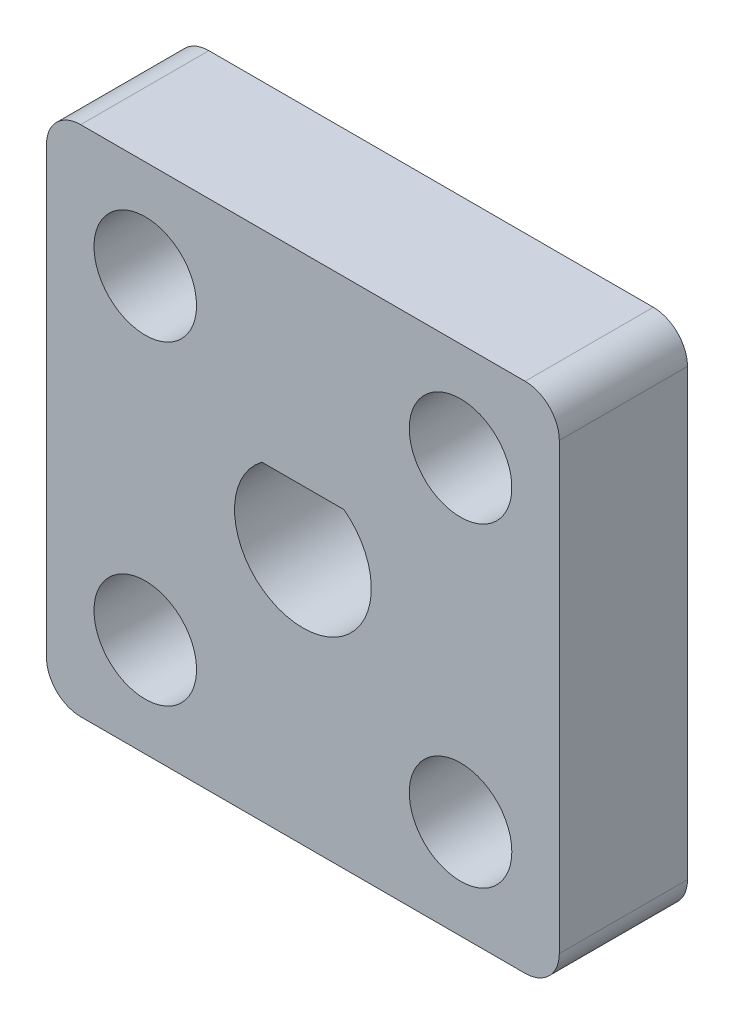
ISO-10303-21;
HEADER;
FILE_DESCRIPTION(('STEP AP214'),'2;1');
FILE_NAME('part.step','',(''),(''),'','','');
FILE_SCHEMA(('AUTOMOTIVE_DESIGN { 1 0 10303 214 1 1 1 1 }'));
ENDSEC;
DATA;
#1=APPLICATION_CONTEXT('core data for automotive mechanical design processes');
#2=APPLICATION_PROTOCOL_DEFINITION('international standard','automotive_design',2000,#1);
#3=PRODUCT_CONTEXT('',#1,'mechanical');
#4=PRODUCT('Part','Part','',(#3));
#5=PRODUCT_RELATED_PRODUCT_CATEGORY('part','',(#4));
#6=PRODUCT_DEFINITION_FORMATION('','',#4);
#7=PRODUCT_DEFINITION_CONTEXT('part definition',#1,'design');
#8=PRODUCT_DEFINITION('design','',#6,#7);
#9=PRODUCT_DEFINITION_SHAPE('','',#8);
#10=(LENGTH_UNIT() NAMED_UNIT(*) SI_UNIT(.MILLI.,.METRE.));
#11=(NAMED_UNIT(*) PLANE_ANGLE_UNIT() SI_UNIT($,.RADIAN.));
#12=(NAMED_UNIT(*) SI_UNIT($,.STERADIAN.) SOLID_ANGLE_UNIT());
#13=UNCERTAINTY_MEASURE_WITH_UNIT(LENGTH_MEASURE(1.E-05),#10,'distance_accuracy_value','');
#14=(GEOMETRIC_REPRESENTATION_CONTEXT(3) GLOBAL_UNCERTAINTY_ASSIGNED_CONTEXT((#13)) GLOBAL_UNIT_ASSIGNED_CONTEXT((#10,
#11,#12)) REPRESENTATION_CONTEXT('',''));
#15=CARTESIAN_POINT('',(0.,0.,0.));
#16=DIRECTION('',(0.,0.,1.));
#17=DIRECTION('',(1.,0.,0.));
#18=AXIS2_PLACEMENT_3D('',#15,#16,#17);
#19=CARTESIAN_POINT('',(-2.89434350433073,13.9923461159468,4.7625));
#20=DIRECTION('',(0.,0.,-1.));
#21=DIRECTION('',(-1.,0.,0.));
#22=AXIS2_PLACEMENT_3D('',#19,#20,#21);
#23=PLANE('',#22);
#24=CARTESIAN_POINT('',(-17.0056523090998,-0.118962688822236,4.7625));
#25=DIRECTION('',(0.,0.,1.));
#26=DIRECTION('',(-1.,0.,0.));
#27=AXIS2_PLACEMENT_3D('',#24,#25,#26);
#28=CIRCLE('',#27,1.905);
#29=CARTESIAN_POINT('',(-18.9106523090998,-0.118962688822236,4.7625));
#30=VERTEX_POINT('',#29);
#31=EDGE_CURVE('E145',#30,#30,#28,.T.);
#32=ORIENTED_EDGE('',*,*,#31,.F.);
#33=EDGE_LOOP('',(#32));
#34=FACE_BOUND('',#33,.T.);
#35=CARTESIAN_POINT('',(-5.29303469956163,-0.118962688822236,4.7625));
#36=DIRECTION('',(0.,0.,1.));
#37=DIRECTION('',(1.,0.,0.));
#38=AXIS2_PLACEMENT_3D('',#35,#36,#37);
#39=CIRCLE('',#38,1.905);
#40=CARTESIAN_POINT('',(-3.38803469956163,-0.118962688822236,4.7625));
#41=VERTEX_POINT('',#40);
#42=EDGE_CURVE('E153',#41,#41,#39,.T.);
#43=ORIENTED_EDGE('',*,*,#42,.F.);
#44=EDGE_LOOP('',(#43));
#45=FACE_BOUND('',#44,.T.);
#46=CARTESIAN_POINT('',(-5.29303469956163,11.5936549207159,4.7625));
#47=DIRECTION('',(0.,0.,1.));
#48=DIRECTION('',(-1.,0.,0.));
#49=AXIS2_PLACEMENT_3D('',#46,#47,#48);
#50=CIRCLE('',#49,1.905);
#51=CARTESIAN_POINT('',(-7.19803469956163,11.5936549207159,4.7625));
#52=VERTEX_POINT('',#51);
#53=EDGE_CURVE('E161',#52,#52,#50,.T.);
#54=ORIENTED_EDGE('',*,*,#53,.F.);
#55=EDGE_LOOP('',(#54));
#56=FACE_BOUND('',#55,.T.);
#57=CARTESIAN_POINT('',(-17.0056523090998,11.5936549207159,4.7625));
#58=DIRECTION('',(0.,0.,1.));
#59=DIRECTION('',(1.,0.,0.));
#60=AXIS2_PLACEMENT_3D('',#57,#58,#59);
#61=CIRCLE('',#60,1.905);
#62=CARTESIAN_POINT('',(-15.1006523090998,11.5936549207159,4.7625));
#63=VERTEX_POINT('',#62);
#64=EDGE_CURVE('E169',#63,#63,#61,.T.);
#65=ORIENTED_EDGE('',*,*,#64,.F.);
#66=EDGE_LOOP('',(#65));
#67=FACE_BOUND('',#66,.T.);
#68=CARTESIAN_POINT('',(-2.89434350433073,13.9923461159468,4.7625));
#69=DIRECTION('',(0.,0.,1.));
#70=DIRECTION('',(-1.,0.,0.));
#71=AXIS2_PLACEMENT_3D('',#68,#69,#70);
#72=CIRCLE('',#71,1.27);
#73=CARTESIAN_POINT('',(-1.62434350433073,13.9923461159468,4.7625));
#74=VERTEX_POINT('',#73);
#75=CARTESIAN_POINT('',(-2.89434350433074,15.2623461159468,4.7625));
#76=VERTEX_POINT('',#75);
#77=EDGE_CURVE('E177',#74,#76,#72,.T.);
#78=ORIENTED_EDGE('',*,*,#77,.T.);
#79=DIRECTION('',(-1.,0.,0.));
#80=VECTOR('',#79,1.);
#81=CARTESIAN_POINT('',(-19.4043435043307,15.2623461159468,4.7625));
#82=LINE('',#81,#80);
#83=CARTESIAN_POINT('',(-19.4043435043307,15.2623461159468,4.7625));
#84=VERTEX_POINT('',#83);
#85=EDGE_CURVE('E181',#76,#84,#82,.T.);
#86=ORIENTED_EDGE('',*,*,#85,.T.);
#87=CARTESIAN_POINT('',(-19.4043435043307,13.9923461159468,4.7625));
#88=DIRECTION('',(0.,0.,1.));
#89=DIRECTION('',(-1.,0.,0.));
#90=AXIS2_PLACEMENT_3D('',#87,#88,#89);
#91=CIRCLE('',#90,1.27);
#92=CARTESIAN_POINT('',(-20.6743435043307,13.9923461159468,4.7625));
#93=VERTEX_POINT('',#92);
#94=EDGE_CURVE('E185',#84,#93,#91,.T.);
#95=ORIENTED_EDGE('',*,*,#94,.T.);
#96=DIRECTION('',(0.,-1.,0.));
#97=VECTOR('',#96,1.);
#98=CARTESIAN_POINT('',(-20.6743435043307,-2.51765388405314,4.7625));
#99=LINE('',#98,#97);
#100=CARTESIAN_POINT('',(-20.6743435043307,-2.51765388405314,4.7625));
#101=VERTEX_POINT('',#100);
#102=EDGE_CURVE('E188',#93,#101,#99,.T.);
#103=ORIENTED_EDGE('',*,*,#102,.T.);
#104=CARTESIAN_POINT('',(-19.4043435043307,-2.51765388405315,4.7625));
#105=DIRECTION('',(0.,0.,1.));
#106=DIRECTION('',(-1.,0.,0.));
#107=AXIS2_PLACEMENT_3D('',#104,#105,#106);
#108=CIRCLE('',#107,1.27);
#109=CARTESIAN_POINT('',(-19.4043435043307,-3.78765388405315,4.7625));
#110=VERTEX_POINT('',#109);
#111=EDGE_CURVE('E191',#101,#110,#108,.T.);
#112=ORIENTED_EDGE('',*,*,#111,.T.);
#113=DIRECTION('',(1.,0.,0.));
#114=VECTOR('',#113,1.);
#115=CARTESIAN_POINT('',(-19.4043435043307,-3.78765388405315,4.7625));
#116=LINE('',#115,#114);
#117=CARTESIAN_POINT('',(-2.89434350433074,-3.78765388405315,4.7625));
#118=VERTEX_POINT('',#117);
#119=EDGE_CURVE('E194',#110,#118,#116,.T.);
#120=ORIENTED_EDGE('',*,*,#119,.T.);
#121=CARTESIAN_POINT('',(-2.89434350433073,-2.51765388405315,4.7625));
#122=DIRECTION('',(0.,0.,1.));
#123=DIRECTION('',(1.,0.,0.));
#124=AXIS2_PLACEMENT_3D('',#121,#122,#123);
#125=CIRCLE('',#124,1.27);
#126=CARTESIAN_POINT('',(-1.62434350433073,-2.51765388405315,4.7625));
#127=VERTEX_POINT('',#126);
#128=EDGE_CURVE('E197',#118,#127,#125,.T.);
#129=ORIENTED_EDGE('',*,*,#128,.T.);
#130=DIRECTION('',(0.,1.,0.));
#131=VECTOR('',#130,1.);
#132=CARTESIAN_POINT('',(-1.62434350433073,-2.51765388405314,4.7625));
#133=LINE('',#132,#131);
#134=EDGE_CURVE('E200',#127,#74,#133,.T.);
#135=ORIENTED_EDGE('',*,*,#134,.T.);
#136=EDGE_LOOP('',(#78,#86,#95,#103,#112,#120,#129,#135));
#137=FACE_BOUND('',#136,.T.);
#138=CARTESIAN_POINT('',(-11.1493435043307,5.73734611594685,4.7625));
#139=DIRECTION('',(0.,0.,1.));
#140=DIRECTION('',(1.,0.,0.));
#141=AXIS2_PLACEMENT_3D('',#138,#139,#140);
#142=CIRCLE('',#141,2.54);
#143=CARTESIAN_POINT('',(-12.6733435043307,7.76934611594685,4.7625));
#144=VERTEX_POINT('',#143);
#145=CARTESIAN_POINT('',(-9.62534350433073,7.76934611594685,4.7625));
#146=VERTEX_POINT('',#145);
#147=EDGE_CURVE('E129',#144,#146,#142,.T.);
#148=ORIENTED_EDGE('',*,*,#147,.F.);
#149=DIRECTION('',(-1.,0.,0.));
#150=VECTOR('',#149,1.);
#151=CARTESIAN_POINT('',(-12.6733435043307,7.76934611594685,4.7625));
#152=LINE('',#151,#150);
#153=EDGE_CURVE('E122',#146,#144,#152,.T.);
#154=ORIENTED_EDGE('',*,*,#153,.F.);
#155=EDGE_LOOP('',(#148,#154));
#156=FACE_BOUND('',#155,.T.);
#157=ADVANCED_FACE('F45',(#34,#45,#56,#67,#137,#156),#23,.F.);
#158=CARTESIAN_POINT('',(-2.89434350433073,13.9923461159468,0.));
#159=DIRECTION('',(0.,0.,-1.));
#160=DIRECTION('',(-1.,0.,0.));
#161=AXIS2_PLACEMENT_3D('',#158,#159,#160);
#162=PLANE('',#161);
#163=CARTESIAN_POINT('',(-5.29303469956163,-0.118962688822236,0.));
#164=DIRECTION('',(0.,0.,1.));
#165=DIRECTION('',(1.,0.,0.));
#166=AXIS2_PLACEMENT_3D('',#163,#164,#165);
#167=CIRCLE('',#166,1.905);
#168=CARTESIAN_POINT('',(-3.38803469956163,-0.118962688822236,0.));
#169=VERTEX_POINT('',#168);
#170=EDGE_CURVE('E149',#169,#169,#167,.T.);
#171=ORIENTED_EDGE('',*,*,#170,.T.);
#172=EDGE_LOOP('',(#171));
#173=FACE_BOUND('',#172,.T.);
#174=CARTESIAN_POINT('',(-17.0056523090998,11.5936549207159,0.));
#175=DIRECTION('',(0.,0.,1.));
#176=DIRECTION('',(1.,0.,0.));
#177=AXIS2_PLACEMENT_3D('',#174,#175,#176);
#178=CIRCLE('',#177,1.905);
#179=CARTESIAN_POINT('',(-15.1006523090998,11.5936549207159,0.));
#180=VERTEX_POINT('',#179);
#181=EDGE_CURVE('E165',#180,#180,#178,.T.);
#182=ORIENTED_EDGE('',*,*,#181,.T.);
#183=EDGE_LOOP('',(#182));
#184=FACE_BOUND('',#183,.T.);
#185=CARTESIAN_POINT('',(-2.89434350433073,13.9923461159468,0.));
#186=DIRECTION('',(0.,0.,1.));
#187=DIRECTION('',(-1.,0.,0.));
#188=AXIS2_PLACEMENT_3D('',#185,#186,#187);
#189=CIRCLE('',#188,1.27);
#190=CARTESIAN_POINT('',(-1.62434350433073,13.9923461159468,0.));
#191=VERTEX_POINT('',#190);
#192=CARTESIAN_POINT('',(-2.89434350433074,15.2623461159468,0.));
#193=VERTEX_POINT('',#192);
#194=EDGE_CURVE('E173',#191,#193,#189,.T.);
#195=ORIENTED_EDGE('',*,*,#194,.F.);
#196=DIRECTION('',(0.,1.,0.));
#197=VECTOR('',#196,1.);
#198=CARTESIAN_POINT('',(-1.62434350433073,-2.51765388405314,0.));
#199=LINE('',#198,#197);
#200=CARTESIAN_POINT('',(-1.62434350433073,-2.51765388405315,0.));
#201=VERTEX_POINT('',#200);
#202=EDGE_CURVE('E182',#201,#191,#199,.T.);
#203=ORIENTED_EDGE('',*,*,#202,.F.);
#204=CARTESIAN_POINT('',(-2.89434350433073,-2.51765388405315,0.));
#205=DIRECTION('',(0.,0.,1.));
#206=DIRECTION('',(1.,0.,0.));
#207=AXIS2_PLACEMENT_3D('',#204,#205,#206);
#208=CIRCLE('',#207,1.27);
#209=CARTESIAN_POINT('',(-2.89434350433074,-3.78765388405315,0.));
#210=VERTEX_POINT('',#209);
#211=EDGE_CURVE('E222',#210,#201,#208,.T.);
#212=ORIENTED_EDGE('',*,*,#211,.F.);
#213=DIRECTION('',(1.,0.,0.));
#214=VECTOR('',#213,1.);
#215=CARTESIAN_POINT('',(-19.4043435043307,-3.78765388405315,0.));
#216=LINE('',#215,#214);
#217=CARTESIAN_POINT('',(-19.4043435043307,-3.78765388405315,0.));
#218=VERTEX_POINT('',#217);
#219=EDGE_CURVE('E219',#218,#210,#216,.T.);
#220=ORIENTED_EDGE('',*,*,#219,.F.);
#221=CARTESIAN_POINT('',(-19.4043435043307,-2.51765388405315,0.));
#222=DIRECTION('',(0.,0.,1.));
#223=DIRECTION('',(-1.,0.,0.));
#224=AXIS2_PLACEMENT_3D('',#221,#222,#223);
#225=CIRCLE('',#224,1.27);
#226=CARTESIAN_POINT('',(-20.6743435043307,-2.51765388405314,0.));
#227=VERTEX_POINT('',#226);
#228=EDGE_CURVE('E216',#227,#218,#225,.T.);
#229=ORIENTED_EDGE('',*,*,#228,.F.);
#230=DIRECTION('',(0.,-1.,0.));
#231=VECTOR('',#230,1.);
#232=CARTESIAN_POINT('',(-20.6743435043307,-2.51765388405314,0.));
#233=LINE('',#232,#231);
#234=CARTESIAN_POINT('',(-20.6743435043307,13.9923461159468,0.));
#235=VERTEX_POINT('',#234);
#236=EDGE_CURVE('E213',#235,#227,#233,.T.);
#237=ORIENTED_EDGE('',*,*,#236,.F.);
#238=CARTESIAN_POINT('',(-19.4043435043307,13.9923461159468,0.));
#239=DIRECTION('',(0.,0.,1.));
#240=DIRECTION('',(-1.,0.,0.));
#241=AXIS2_PLACEMENT_3D('',#238,#239,#240);
#242=CIRCLE('',#241,1.27);
#243=CARTESIAN_POINT('',(-19.4043435043307,15.2623461159468,0.));
#244=VERTEX_POINT('',#243);
#245=EDGE_CURVE('E210',#244,#235,#242,.T.);
#246=ORIENTED_EDGE('',*,*,#245,.F.);
#247=DIRECTION('',(-1.,0.,0.));
#248=VECTOR('',#247,1.);
#249=CARTESIAN_POINT('',(-19.4043435043307,15.2623461159468,0.));
#250=LINE('',#249,#248);
#251=EDGE_CURVE('E207',#193,#244,#250,.T.);
#252=ORIENTED_EDGE('',*,*,#251,.F.);
#253=EDGE_LOOP('',(#195,#203,#212,#220,#229,#237,#246,#252));
#254=FACE_BOUND('',#253,.T.);
#255=CARTESIAN_POINT('',(-5.29303469956163,11.5936549207159,0.));
#256=DIRECTION('',(0.,0.,1.));
#257=DIRECTION('',(-1.,0.,0.));
#258=AXIS2_PLACEMENT_3D('',#255,#256,#257);
#259=CIRCLE('',#258,1.905);
#260=CARTESIAN_POINT('',(-7.19803469956163,11.5936549207159,0.));
#261=VERTEX_POINT('',#260);
#262=EDGE_CURVE('E157',#261,#261,#259,.T.);
#263=ORIENTED_EDGE('',*,*,#262,.T.);
#264=EDGE_LOOP('',(#263));
#265=FACE_BOUND('',#264,.T.);
#266=CARTESIAN_POINT('',(-17.0056523090998,-0.118962688822236,0.));
#267=DIRECTION('',(0.,0.,1.));
#268=DIRECTION('',(-1.,0.,0.));
#269=AXIS2_PLACEMENT_3D('',#266,#267,#268);
#270=CIRCLE('',#269,1.905);
#271=CARTESIAN_POINT('',(-18.9106523090998,-0.118962688822236,0.));
#272=VERTEX_POINT('',#271);
#273=EDGE_CURVE('E144',#272,#272,#270,.T.);
#274=ORIENTED_EDGE('',*,*,#273,.T.);
#275=EDGE_LOOP('',(#274));
#276=FACE_BOUND('',#275,.T.);
#277=DIRECTION('',(-1.,0.,0.));
#278=VECTOR('',#277,1.);
#279=CARTESIAN_POINT('',(-12.6733435043307,7.76934611594685,0.));
#280=LINE('',#279,#278);
#281=CARTESIAN_POINT('',(-9.62534350433073,7.76934611594685,0.));
#282=VERTEX_POINT('',#281);
#283=CARTESIAN_POINT('',(-12.6733435043307,7.76934611594685,0.));
#284=VERTEX_POINT('',#283);
#285=EDGE_CURVE('E135',#282,#284,#280,.T.);
#286=ORIENTED_EDGE('',*,*,#285,.T.);
#287=CARTESIAN_POINT('',(-11.1493435043307,5.73734611594685,0.));
#288=DIRECTION('',(0.,0.,1.));
#289=DIRECTION('',(1.,0.,0.));
#290=AXIS2_PLACEMENT_3D('',#287,#288,#289);
#291=CIRCLE('',#290,2.54);
#292=EDGE_CURVE('E68',#284,#282,#291,.T.);
#293=ORIENTED_EDGE('',*,*,#292,.T.);
#294=EDGE_LOOP('',(#286,#293));
#295=FACE_BOUND('',#294,.T.);
#296=ADVANCED_FACE('F261',(#173,#184,#254,#265,#276,#295),#162,.T.);
#297=CARTESIAN_POINT('',(-2.89434350433073,13.9923461159468,4.7625));
#298=DIRECTION('',(0.,0.,-1.));
#299=DIRECTION('',(-1.,0.,0.));
#300=AXIS2_PLACEMENT_3D('',#297,#298,#299);
#301=CYLINDRICAL_SURFACE('',#300,1.27);
#302=ORIENTED_EDGE('',*,*,#194,.T.);
#303=DIRECTION('',(0.,0.,-1.));
#304=VECTOR('',#303,1.);
#305=CARTESIAN_POINT('',(-2.89434350433074,15.2623461159468,4.7625));
#306=LINE('',#305,#304);
#307=EDGE_CURVE('E11',#76,#193,#306,.T.);
#308=ORIENTED_EDGE('',*,*,#307,.F.);
#309=ORIENTED_EDGE('',*,*,#77,.F.);
#310=DIRECTION('',(0.,0.,-1.));
#311=VECTOR('',#310,1.);
#312=CARTESIAN_POINT('',(-1.62434350433073,13.9923461159468,4.7625));
#313=LINE('',#312,#311);
#314=EDGE_CURVE('E203',#74,#191,#313,.T.);
#315=ORIENTED_EDGE('',*,*,#314,.T.);
#316=EDGE_LOOP('',(#302,#308,#309,#315));
#317=FACE_BOUND('',#316,.T.);
#318=ADVANCED_FACE('F47',(#317),#301,.T.);
#319=CARTESIAN_POINT('',(-19.4043435043307,15.2623461159468,4.7625));
#320=DIRECTION('',(0.,-1.,0.));
#321=DIRECTION('',(0.,0.,-1.));
#322=AXIS2_PLACEMENT_3D('',#319,#320,#321);
#323=PLANE('',#322);
#324=ORIENTED_EDGE('',*,*,#251,.T.);
#325=DIRECTION('',(0.,0.,-1.));
#326=VECTOR('',#325,1.);
#327=CARTESIAN_POINT('',(-19.4043435043307,15.2623461159468,4.7625));
#328=LINE('',#327,#326);
#329=EDGE_CURVE('E54',#84,#244,#328,.T.);
#330=ORIENTED_EDGE('',*,*,#329,.F.);
#331=ORIENTED_EDGE('',*,*,#85,.F.);
#332=ORIENTED_EDGE('',*,*,#307,.T.);
#333=EDGE_LOOP('',(#324,#330,#331,#332));
#334=FACE_BOUND('',#333,.T.);
#335=ADVANCED_FACE('F278',(#334),#323,.F.);
#336=CARTESIAN_POINT('',(-19.4043435043307,13.9923461159468,4.7625));
#337=DIRECTION('',(0.,0.,-1.));
#338=DIRECTION('',(-1.,0.,0.));
#339=AXIS2_PLACEMENT_3D('',#336,#337,#338);
#340=CYLINDRICAL_SURFACE('',#339,1.27);
#341=ORIENTED_EDGE('',*,*,#245,.T.);
#342=DIRECTION('',(0.,0.,-1.));
#343=VECTOR('',#342,1.);
#344=CARTESIAN_POINT('',(-20.6743435043307,13.9923461159468,4.7625));
#345=LINE('',#344,#343);
#346=EDGE_CURVE('E246',#93,#235,#345,.T.);
#347=ORIENTED_EDGE('',*,*,#346,.F.);
#348=ORIENTED_EDGE('',*,*,#94,.F.);
#349=ORIENTED_EDGE('',*,*,#329,.T.);
#350=EDGE_LOOP('',(#341,#347,#348,#349));
#351=FACE_BOUND('',#350,.T.);
#352=ADVANCED_FACE('F255',(#351),#340,.T.);
#353=CARTESIAN_POINT('',(-20.6743435043307,-2.51765388405314,4.7625));
#354=DIRECTION('',(1.,0.,0.));
#355=DIRECTION('',(0.,0.,-1.));
#356=AXIS2_PLACEMENT_3D('',#353,#354,#355);
#357=PLANE('',#356);
#358=ORIENTED_EDGE('',*,*,#236,.T.);
#359=DIRECTION('',(0.,0.,-1.));
#360=VECTOR('',#359,1.);
#361=CARTESIAN_POINT('',(-20.6743435043307,-2.51765388405314,4.7625));
#362=LINE('',#361,#360);
#363=EDGE_CURVE('E242',#101,#227,#362,.T.);
#364=ORIENTED_EDGE('',*,*,#363,.F.);
#365=ORIENTED_EDGE('',*,*,#102,.F.);
#366=ORIENTED_EDGE('',*,*,#346,.T.);
#367=EDGE_LOOP('',(#358,#364,#365,#366));
#368=FACE_BOUND('',#367,.T.);
#369=ADVANCED_FACE('F267',(#368),#357,.F.);
#370=CARTESIAN_POINT('',(-19.4043435043307,-2.51765388405315,4.7625));
#371=DIRECTION('',(0.,0.,-1.));
#372=DIRECTION('',(-1.,0.,0.));
#373=AXIS2_PLACEMENT_3D('',#370,#371,#372);
#374=CYLINDRICAL_SURFACE('',#373,1.27);
#375=ORIENTED_EDGE('',*,*,#228,.T.);
#376=DIRECTION('',(0.,0.,-1.));
#377=VECTOR('',#376,1.);
#378=CARTESIAN_POINT('',(-19.4043435043307,-3.78765388405315,4.7625));
#379=LINE('',#378,#377);
#380=EDGE_CURVE('E238',#110,#218,#379,.T.);
#381=ORIENTED_EDGE('',*,*,#380,.F.);
#382=ORIENTED_EDGE('',*,*,#111,.F.);
#383=ORIENTED_EDGE('',*,*,#363,.T.);
#384=EDGE_LOOP('',(#375,#381,#382,#383));
#385=FACE_BOUND('',#384,.T.);
#386=ADVANCED_FACE('F271',(#385),#374,.T.);
#387=CARTESIAN_POINT('',(-19.4043435043307,-3.78765388405315,4.7625));
#388=DIRECTION('',(0.,1.,0.));
#389=DIRECTION('',(0.,0.,1.));
#390=AXIS2_PLACEMENT_3D('',#387,#388,#389);
#391=PLANE('',#390);
#392=ORIENTED_EDGE('',*,*,#219,.T.);
#393=DIRECTION('',(0.,0.,-1.));
#394=VECTOR('',#393,1.);
#395=CARTESIAN_POINT('',(-2.89434350433074,-3.78765388405315,4.7625));
#396=LINE('',#395,#394);
#397=EDGE_CURVE('E234',#118,#210,#396,.T.);
#398=ORIENTED_EDGE('',*,*,#397,.F.);
#399=ORIENTED_EDGE('',*,*,#119,.F.);
#400=ORIENTED_EDGE('',*,*,#380,.T.);
#401=EDGE_LOOP('',(#392,#398,#399,#400));
#402=FACE_BOUND('',#401,.T.);
#403=ADVANCED_FACE('F291',(#402),#391,.F.);
#404=CARTESIAN_POINT('',(-2.89434350433073,-2.51765388405315,4.7625));
#405=DIRECTION('',(0.,0.,-1.));
#406=DIRECTION('',(-1.,0.,0.));
#407=AXIS2_PLACEMENT_3D('',#404,#405,#406);
#408=CYLINDRICAL_SURFACE('',#407,1.27);
#409=ORIENTED_EDGE('',*,*,#211,.T.);
#410=DIRECTION('',(0.,0.,-1.));
#411=VECTOR('',#410,1.);
#412=CARTESIAN_POINT('',(-1.62434350433073,-2.51765388405315,4.7625));
#413=LINE('',#412,#411);
#414=EDGE_CURVE('E230',#127,#201,#413,.T.);
#415=ORIENTED_EDGE('',*,*,#414,.F.);
#416=ORIENTED_EDGE('',*,*,#128,.F.);
#417=ORIENTED_EDGE('',*,*,#397,.T.);
#418=EDGE_LOOP('',(#409,#415,#416,#417));
#419=FACE_BOUND('',#418,.T.);
#420=ADVANCED_FACE('F289',(#419),#408,.T.);
#421=CARTESIAN_POINT('',(-1.62434350433073,-2.51765388405314,4.7625));
#422=DIRECTION('',(-1.,0.,0.));
#423=DIRECTION('',(0.,0.,1.));
#424=AXIS2_PLACEMENT_3D('',#421,#422,#423);
#425=PLANE('',#424);
#426=ORIENTED_EDGE('',*,*,#202,.T.);
#427=ORIENTED_EDGE('',*,*,#314,.F.);
#428=ORIENTED_EDGE('',*,*,#134,.F.);
#429=ORIENTED_EDGE('',*,*,#414,.T.);
#430=EDGE_LOOP('',(#426,#427,#428,#429));
#431=FACE_BOUND('',#430,.T.);
#432=ADVANCED_FACE('F284',(#431),#425,.F.);
#433=CARTESIAN_POINT('',(-17.0056523090998,11.5936549207159,4.7625));
#434=DIRECTION('',(0.,0.,-1.));
#435=DIRECTION('',(-1.,0.,0.));
#436=AXIS2_PLACEMENT_3D('',#433,#434,#435);
#437=CYLINDRICAL_SURFACE('',#436,1.905);
#438=ORIENTED_EDGE('',*,*,#64,.T.);
#439=EDGE_LOOP('',(#438));
#440=FACE_BOUND('',#439,.T.);
#441=ORIENTED_EDGE('',*,*,#181,.F.);
#442=EDGE_LOOP('',(#441));
#443=FACE_BOUND('',#442,.T.);
#444=ADVANCED_FACE('F311',(#440,#443),#437,.F.);
#445=CARTESIAN_POINT('',(-5.29303469956163,11.5936549207159,4.7625));
#446=DIRECTION('',(0.,0.,-1.));
#447=DIRECTION('',(-1.,0.,0.));
#448=AXIS2_PLACEMENT_3D('',#445,#446,#447);
#449=CYLINDRICAL_SURFACE('',#448,1.905);
#450=ORIENTED_EDGE('',*,*,#53,.T.);
#451=EDGE_LOOP('',(#450));
#452=FACE_BOUND('',#451,.T.);
#453=ORIENTED_EDGE('',*,*,#262,.F.);
#454=EDGE_LOOP('',(#453));
#455=FACE_BOUND('',#454,.T.);
#456=ADVANCED_FACE('F318',(#452,#455),#449,.F.);
#457=CARTESIAN_POINT('',(-5.29303469956163,-0.118962688822236,4.7625));
#458=DIRECTION('',(0.,0.,-1.));
#459=DIRECTION('',(-1.,0.,0.));
#460=AXIS2_PLACEMENT_3D('',#457,#458,#459);
#461=CYLINDRICAL_SURFACE('',#460,1.905);
#462=ORIENTED_EDGE('',*,*,#42,.T.);
#463=EDGE_LOOP('',(#462));
#464=FACE_BOUND('',#463,.T.);
#465=ORIENTED_EDGE('',*,*,#170,.F.);
#466=EDGE_LOOP('',(#465));
#467=FACE_BOUND('',#466,.T.);
#468=ADVANCED_FACE('F323',(#464,#467),#461,.F.);
#469=CARTESIAN_POINT('',(-17.0056523090998,-0.118962688822236,4.7625));
#470=DIRECTION('',(0.,0.,-1.));
#471=DIRECTION('',(-1.,0.,0.));
#472=AXIS2_PLACEMENT_3D('',#469,#470,#471);
#473=CYLINDRICAL_SURFACE('',#472,1.905);
#474=ORIENTED_EDGE('',*,*,#31,.T.);
#475=EDGE_LOOP('',(#474));
#476=FACE_BOUND('',#475,.T.);
#477=ORIENTED_EDGE('',*,*,#273,.F.);
#478=EDGE_LOOP('',(#477));
#479=FACE_BOUND('',#478,.T.);
#480=ADVANCED_FACE('F333',(#476,#479),#473,.F.);
#481=CARTESIAN_POINT('',(-11.1493435043307,5.73734611594685,4.7625));
#482=DIRECTION('',(0.,0.,-1.));
#483=DIRECTION('',(-1.,0.,0.));
#484=AXIS2_PLACEMENT_3D('',#481,#482,#483);
#485=CYLINDRICAL_SURFACE('',#484,2.54);
#486=ORIENTED_EDGE('',*,*,#292,.F.);
#487=DIRECTION('',(0.,0.,-1.));
#488=VECTOR('',#487,1.);
#489=CARTESIAN_POINT('',(-12.6733435043307,7.76934611594685,4.7625));
#490=LINE('',#489,#488);
#491=EDGE_CURVE('E124',#144,#284,#490,.T.);
#492=ORIENTED_EDGE('',*,*,#491,.F.);
#493=ORIENTED_EDGE('',*,*,#147,.T.);
#494=DIRECTION('',(0.,0.,-1.));
#495=VECTOR('',#494,1.);
#496=CARTESIAN_POINT('',(-9.62534350433073,7.76934611594685,4.7625));
#497=LINE('',#496,#495);
#498=EDGE_CURVE('E61',#146,#282,#497,.T.);
#499=ORIENTED_EDGE('',*,*,#498,.T.);
#500=EDGE_LOOP('',(#486,#492,#493,#499));
#501=FACE_BOUND('',#500,.T.);
#502=ADVANCED_FACE('F131',(#501),#485,.F.);
#503=CARTESIAN_POINT('',(-12.6733435043307,7.76934611594685,4.7625));
#504=DIRECTION('',(0.,-1.,0.));
#505=DIRECTION('',(0.,0.,-1.));
#506=AXIS2_PLACEMENT_3D('',#503,#504,#505);
#507=PLANE('',#506);
#508=ORIENTED_EDGE('',*,*,#285,.F.);
#509=ORIENTED_EDGE('',*,*,#498,.F.);
#510=ORIENTED_EDGE('',*,*,#153,.T.);
#511=ORIENTED_EDGE('',*,*,#491,.T.);
#512=EDGE_LOOP('',(#508,#509,#510,#511));
#513=FACE_BOUND('',#512,.T.);
#514=ADVANCED_FACE('F123',(#513),#507,.T.);
#515=CLOSED_SHELL('',(#157,#296,#318,#335,#352,#369,#386,#403,#420,#432,#444,#456,#468,#480,
#502,#514));
#516=MANIFOLD_SOLID_BREP('B2',#515);
#517=ADVANCED_BREP_SHAPE_REPRESENTATION('',(#18,#516),#14);
#518=SHAPE_DEFINITION_REPRESENTATION(#9,#517);
ENDSEC;
END-ISO-10303-21;
